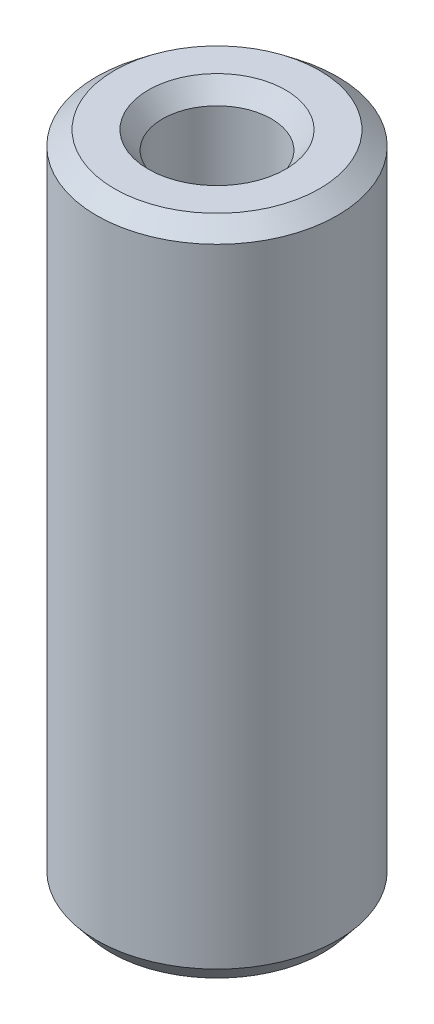
ISO-10303-21;
HEADER;
FILE_DESCRIPTION(('STEP AP214'),'2;1');
FILE_NAME('part.step','',(''),(''),'','','');
FILE_SCHEMA(('AUTOMOTIVE_DESIGN { 1 0 10303 214 1 1 1 1 }'));
ENDSEC;
DATA;
#1=APPLICATION_CONTEXT('core data for automotive mechanical design processes');
#2=APPLICATION_PROTOCOL_DEFINITION('international standard','automotive_design',2000,#1);
#3=PRODUCT_CONTEXT('',#1,'mechanical');
#4=PRODUCT('Part','Part','',(#3));
#5=PRODUCT_RELATED_PRODUCT_CATEGORY('part','',(#4));
#6=PRODUCT_DEFINITION_FORMATION('','',#4);
#7=PRODUCT_DEFINITION_CONTEXT('part definition',#1,'design');
#8=PRODUCT_DEFINITION('design','',#6,#7);
#9=PRODUCT_DEFINITION_SHAPE('','',#8);
#10=(LENGTH_UNIT() NAMED_UNIT(*) SI_UNIT(.MILLI.,.METRE.));
#11=(NAMED_UNIT(*) PLANE_ANGLE_UNIT() SI_UNIT($,.RADIAN.));
#12=(NAMED_UNIT(*) SI_UNIT($,.STERADIAN.) SOLID_ANGLE_UNIT());
#13=UNCERTAINTY_MEASURE_WITH_UNIT(LENGTH_MEASURE(1.E-05),#10,'distance_accuracy_value','');
#14=(GEOMETRIC_REPRESENTATION_CONTEXT(3) GLOBAL_UNCERTAINTY_ASSIGNED_CONTEXT((#13)) GLOBAL_UNIT_ASSIGNED_CONTEXT((#10,
#11,#12)) REPRESENTATION_CONTEXT('',''));
#15=CARTESIAN_POINT('',(0.,0.,0.));
#16=DIRECTION('',(0.,0.,1.));
#17=DIRECTION('',(1.,0.,0.));
#18=AXIS2_PLACEMENT_3D('',#15,#16,#17);
#19=CARTESIAN_POINT('',(0.,95.9355146550826,0.));
#20=DIRECTION('',(0.,-1.,0.));
#21=DIRECTION('',(0.,0.,-1.));
#22=AXIS2_PLACEMENT_3D('',#19,#20,#21);
#23=CYLINDRICAL_SURFACE('',#22,17.5);
#24=CARTESIAN_POINT('',(0.,2.5937585847688,0.));
#25=DIRECTION('',(0.,1.,0.));
#26=DIRECTION('',(0.,0.,1.));
#27=AXIS2_PLACEMENT_3D('',#24,#25,#26);
#28=CIRCLE('',#27,17.5);
#29=CARTESIAN_POINT('',(0.,2.59375858476879,-17.5));
#30=VERTEX_POINT('',#29);
#31=EDGE_CURVE('E10',#30,#30,#28,.T.);
#32=CARTESIAN_POINT('',(0.,93.8617802418051,0.));
#33=DIRECTION('',(0.,1.,0.));
#34=DIRECTION('',(0.,0.,1.));
#35=AXIS2_PLACEMENT_3D('',#32,#33,#34);
#36=CIRCLE('',#35,17.5);
#37=CARTESIAN_POINT('',(0.,93.861780241805,-17.5));
#38=VERTEX_POINT('',#37);
#39=EDGE_CURVE('E50',#38,#38,#36,.F.);
#40=CARTESIAN_POINT('',(0.,2.59375858476879,-17.5));
#41=CARTESIAN_POINT('',(0.,3.54446714369625,-17.5));
#42=CARTESIAN_POINT('',(0.,4.49517570262371,-17.5));
#43=CARTESIAN_POINT('',(0.,6.39659282047863,-17.5));
#44=CARTESIAN_POINT('',(0.,7.34730137940609,-17.5));
#45=CARTESIAN_POINT('',(0.,9.24871849726102,-17.5));
#46=CARTESIAN_POINT('',(0.,10.1994270561885,-17.5));
#47=CARTESIAN_POINT('',(0.,12.1008441740434,-17.5));
#48=CARTESIAN_POINT('',(0.,13.0515527329709,-17.5));
#49=CARTESIAN_POINT('',(0.,14.9529698508258,-17.5));
#50=CARTESIAN_POINT('',(0.,15.9036784097532,-17.5));
#51=CARTESIAN_POINT('',(0.,17.8050955276082,-17.5));
#52=CARTESIAN_POINT('',(0.,18.7558040865356,-17.5));
#53=CARTESIAN_POINT('',(0.,20.6572212043905,-17.5));
#54=CARTESIAN_POINT('',(0.,21.607929763318,-17.5));
#55=CARTESIAN_POINT('',(0.,23.5093468811729,-17.5));
#56=CARTESIAN_POINT('',(0.,24.4600554401004,-17.5));
#57=CARTESIAN_POINT('',(0.,26.3614725579553,-17.5));
#58=CARTESIAN_POINT('',(0.,27.3121811168828,-17.5));
#59=CARTESIAN_POINT('',(0.,29.2135982347377,-17.5));
#60=CARTESIAN_POINT('',(0.,30.1643067936652,-17.5));
#61=CARTESIAN_POINT('',(0.,32.0657239115201,-17.5));
#62=CARTESIAN_POINT('',(0.,33.0164324704475,-17.5));
#63=CARTESIAN_POINT('',(0.,34.9178495883025,-17.5));
#64=CARTESIAN_POINT('',(0.,35.8685581472299,-17.5));
#65=CARTESIAN_POINT('',(0.,37.7699752650848,-17.5));
#66=CARTESIAN_POINT('',(0.,38.7206838240123,-17.5));
#67=CARTESIAN_POINT('',(0.,40.6221009418672,-17.5));
#68=CARTESIAN_POINT('',(0.,41.5728095007947,-17.5));
#69=CARTESIAN_POINT('',(0.,43.4742266186496,-17.5));
#70=CARTESIAN_POINT('',(0.,44.4249351775771,-17.5));
#71=CARTESIAN_POINT('',(0.,46.326352295432,-17.5));
#72=CARTESIAN_POINT('',(0.,47.2770608543595,-17.5));
#73=CARTESIAN_POINT('',(0.,49.1784779722144,-17.5));
#74=CARTESIAN_POINT('',(0.,50.1291865311418,-17.5));
#75=CARTESIAN_POINT('',(0.,52.0306036489968,-17.5));
#76=CARTESIAN_POINT('',(0.,52.9813122079242,-17.5));
#77=CARTESIAN_POINT('',(0.,54.8827293257791,-17.5));
#78=CARTESIAN_POINT('',(0.,55.8334378847066,-17.5));
#79=CARTESIAN_POINT('',(0.,57.7348550025615,-17.5));
#80=CARTESIAN_POINT('',(0.,58.685563561489,-17.5));
#81=CARTESIAN_POINT('',(0.,60.5869806793439,-17.5));
#82=CARTESIAN_POINT('',(0.,61.5376892382714,-17.5));
#83=CARTESIAN_POINT('',(0.,63.4391063561263,-17.5));
#84=CARTESIAN_POINT('',(0.,64.3898149150537,-17.5));
#85=CARTESIAN_POINT('',(0.,66.2912320329087,-17.5));
#86=CARTESIAN_POINT('',(0.,67.2419405918361,-17.5));
#87=CARTESIAN_POINT('',(0.,69.143357709691,-17.5));
#88=CARTESIAN_POINT('',(0.,70.0940662686185,-17.5));
#89=CARTESIAN_POINT('',(0.,71.9954833864734,-17.5));
#90=CARTESIAN_POINT('',(0.,72.9461919454009,-17.5));
#91=CARTESIAN_POINT('',(0.,74.8476090632558,-17.5));
#92=CARTESIAN_POINT('',(0.,75.7983176221833,-17.5));
#93=CARTESIAN_POINT('',(0.,77.6997347400382,-17.5));
#94=CARTESIAN_POINT('',(0.,78.6504432989657,-17.5));
#95=CARTESIAN_POINT('',(0.,80.5518604168206,-17.5));
#96=CARTESIAN_POINT('',(0.,81.502568975748,-17.5));
#97=CARTESIAN_POINT('',(0.,83.403986093603,-17.5));
#98=CARTESIAN_POINT('',(0.,84.3546946525304,-17.5));
#99=CARTESIAN_POINT('',(0.,86.2561117703853,-17.5));
#100=CARTESIAN_POINT('',(0.,87.2068203293128,-17.5));
#101=CARTESIAN_POINT('',(0.,89.1082374471677,-17.5));
#102=CARTESIAN_POINT('',(0.,90.0589460060952,-17.5));
#103=CARTESIAN_POINT('',(0.,91.9603631239501,-17.5));
#104=CARTESIAN_POINT('',(0.,92.9110716828776,-17.5));
#105=CARTESIAN_POINT('',(0.,93.861780241805,-17.5));
#106=B_SPLINE_CURVE_WITH_KNOTS('',3,(#40,#41,#42,#43,#44,#45,#46,#47,#48,#49,#50,#51,#52,#53,
#54,#55,#56,#57,#58,#59,#60,#61,#62,#63,#64,#65,#66,#67,#68,#69,#70,#71,#72,#73,#74,#75,#76,#77,
#78,#79,#80,#81,#82,#83,#84,#85,#86,#87,#88,#89,#90,#91,#92,#93,#94,#95,#96,#97,#98,#99,#100,
#101,#102,#103,#104,#105),.UNSPECIFIED.,.F.,.F.,(4,2,2,2,2,2,2,2,2,2,2,2,2,2,2,2,2,2,2,2,2,2,2,
2,2,2,2,2,2,2,2,2,4),(0.,2.85212567678238,5.70425135356477,8.55637703034714,11.4085027071295,
14.2606283839119,17.1127540606943,19.9648797374767,22.8170054142591,25.6691310910415,
28.5212567678238,31.3733824446062,34.2255081213886,37.077633798171,39.9297594749534,
42.7818851517357,45.6340108285181,48.4861365053005,51.3382621820829,54.1903878588653,
57.0425135356477,59.89463921243,62.7467648892124,65.5988905659948,68.4510162427772,
71.3031419195596,74.1552675963419,77.0073932731243,79.8595189499067,82.7116446266891,
85.5637703034715,88.4158959802539,91.2680216570362),.UNSPECIFIED.);
#107=EDGE_CURVE('BSEAM39',#30,#38,#106,.T.);
#108=ORIENTED_EDGE('',*,*,#31,.T.);
#109=ORIENTED_EDGE('',*,*,#39,.T.);
#110=ORIENTED_EDGE('',*,*,#107,.T.);
#111=ORIENTED_EDGE('',*,*,#107,.F.);
#112=EDGE_LOOP('',(#108,#110,#109,#111));
#113=FACE_BOUND('',#112,.T.);
#114=ADVANCED_FACE('F39',(#113),#23,.T.);
#115=CARTESIAN_POINT('',(0.,95.9355146550826,0.));
#116=DIRECTION('',(0.,1.,0.));
#117=DIRECTION('',(0.,0.,1.));
#118=AXIS2_PLACEMENT_3D('',#115,#116,#117);
#119=PLANE('',#118);
#120=CARTESIAN_POINT('',(0.,95.9355146550826,0.));
#121=DIRECTION('',(0.,1.,0.));
#122=DIRECTION('',(0.,0.,1.));
#123=AXIS2_PLACEMENT_3D('',#120,#121,#122);
#124=CIRCLE('',#123,9.98302959360785);
#125=CARTESIAN_POINT('',(0.,95.9355146550826,9.98302959360785));
#126=VERTEX_POINT('',#125);
#127=EDGE_CURVE('E58',#126,#126,#124,.F.);
#128=ORIENTED_EDGE('',*,*,#127,.T.);
#129=EDGE_LOOP('',(#128));
#130=FACE_BOUND('',#129,.T.);
#131=CARTESIAN_POINT('',(0.,95.9355146550826,0.));
#132=DIRECTION('',(0.,1.,0.));
#133=DIRECTION('',(0.,0.,1.));
#134=AXIS2_PLACEMENT_3D('',#131,#132,#133);
#135=CIRCLE('',#134,14.9062414152314);
#136=CARTESIAN_POINT('',(0.,95.9355146550826,14.9062414152314));
#137=VERTEX_POINT('',#136);
#138=EDGE_CURVE('E61',#137,#137,#135,.T.);
#139=ORIENTED_EDGE('',*,*,#138,.T.);
#140=EDGE_LOOP('',(#139));
#141=FACE_BOUND('',#140,.T.);
#142=ADVANCED_FACE('F88',(#130,#141),#119,.T.);
#143=CARTESIAN_POINT('',(0.,0.,0.));
#144=DIRECTION('',(0.,1.,0.));
#145=DIRECTION('',(0.,0.,1.));
#146=AXIS2_PLACEMENT_3D('',#143,#144,#145);
#147=PLANE('',#146);
#148=CARTESIAN_POINT('',(0.,0.,0.));
#149=DIRECTION('',(0.,1.,0.));
#150=DIRECTION('',(0.,0.,1.));
#151=AXIS2_PLACEMENT_3D('',#148,#149,#150);
#152=CIRCLE('',#151,10.5030537650989);
#153=CARTESIAN_POINT('',(0.,0.,10.5030537650989));
#154=VERTEX_POINT('',#153);
#155=EDGE_CURVE('E51',#154,#154,#152,.T.);
#156=ORIENTED_EDGE('',*,*,#155,.T.);
#157=EDGE_LOOP('',(#156));
#158=FACE_BOUND('',#157,.T.);
#159=CARTESIAN_POINT('',(0.,0.,0.));
#160=DIRECTION('',(0.,1.,0.));
#161=DIRECTION('',(0.,0.,1.));
#162=AXIS2_PLACEMENT_3D('',#159,#160,#161);
#163=CIRCLE('',#162,15.4262655867223);
#164=CARTESIAN_POINT('',(0.,0.,15.4262655867223));
#165=VERTEX_POINT('',#164);
#166=EDGE_CURVE('E54',#165,#165,#163,.F.);
#167=ORIENTED_EDGE('',*,*,#166,.T.);
#168=EDGE_LOOP('',(#167));
#169=FACE_BOUND('',#168,.T.);
#170=ADVANCED_FACE('F83',(#158,#169),#147,.F.);
#171=CARTESIAN_POINT('',(0.,95.9355146550826,0.));
#172=DIRECTION('',(0.,-1.,0.));
#173=DIRECTION('',(0.,0.,-1.));
#174=AXIS2_PLACEMENT_3D('',#171,#172,#173);
#175=CYLINDRICAL_SURFACE('',#174,7.90929518033019);
#176=CARTESIAN_POINT('',(0.,93.3417560703138,0.));
#177=DIRECTION('',(0.,1.,0.));
#178=DIRECTION('',(0.,0.,1.));
#179=AXIS2_PLACEMENT_3D('',#176,#177,#178);
#180=CIRCLE('',#179,7.90929518033019);
#181=CARTESIAN_POINT('',(0.,93.3417560703138,-7.90929518033019));
#182=VERTEX_POINT('',#181);
#183=EDGE_CURVE('E67',#182,#182,#180,.T.);
#184=CARTESIAN_POINT('',(0.,2.07373441327757,0.));
#185=DIRECTION('',(0.,1.,0.));
#186=DIRECTION('',(0.,0.,1.));
#187=AXIS2_PLACEMENT_3D('',#184,#185,#186);
#188=CIRCLE('',#187,7.90929518033019);
#189=CARTESIAN_POINT('',(0.,2.07373441327757,-7.90929518033019));
#190=VERTEX_POINT('',#189);
#191=EDGE_CURVE('E69',#190,#190,#188,.F.);
#192=CARTESIAN_POINT('',(0.,93.3417560703138,-7.90929518033019));
#193=CARTESIAN_POINT('',(0.,92.3910475113863,-7.90929518033019));
#194=CARTESIAN_POINT('',(0.,91.4403389524588,-7.90929518033019));
#195=CARTESIAN_POINT('',(0.,89.5389218346039,-7.90929518033019));
#196=CARTESIAN_POINT('',(0.,88.5882132756765,-7.90929518033019));
#197=CARTESIAN_POINT('',(0.,86.6867961578216,-7.90929518033019));
#198=CARTESIAN_POINT('',(0.,85.7360875988941,-7.90929518033019));
#199=CARTESIAN_POINT('',(0.,83.8346704810392,-7.90929518033019));
#200=CARTESIAN_POINT('',(0.,82.8839619221117,-7.90929518033019));
#201=CARTESIAN_POINT('',(0.,80.9825448042568,-7.90929518033019));
#202=CARTESIAN_POINT('',(0.,80.0318362453293,-7.90929518033019));
#203=CARTESIAN_POINT('',(0.,78.1304191274744,-7.90929518033019));
#204=CARTESIAN_POINT('',(0.,77.1797105685469,-7.90929518033019));
#205=CARTESIAN_POINT('',(0.,75.278293450692,-7.90929518033019));
#206=CARTESIAN_POINT('',(0.,74.3275848917646,-7.90929518033019));
#207=CARTESIAN_POINT('',(0.,72.4261677739096,-7.90929518033019));
#208=CARTESIAN_POINT('',(0.,71.4754592149822,-7.90929518033019));
#209=CARTESIAN_POINT('',(0.,69.5740420971273,-7.90929518033019));
#210=CARTESIAN_POINT('',(0.,68.6233335381998,-7.90929518033019));
#211=CARTESIAN_POINT('',(0.,66.7219164203449,-7.90929518033019));
#212=CARTESIAN_POINT('',(0.,65.7712078614174,-7.90929518033019));
#213=CARTESIAN_POINT('',(0.,63.8697907435625,-7.90929518033019));
#214=CARTESIAN_POINT('',(0.,62.919082184635,-7.90929518033019));
#215=CARTESIAN_POINT('',(0.,61.0176650667801,-7.90929518033019));
#216=CARTESIAN_POINT('',(0.,60.0669565078527,-7.90929518033019));
#217=CARTESIAN_POINT('',(0.,58.1655393899977,-7.90929518033019));
#218=CARTESIAN_POINT('',(0.,57.2148308310703,-7.90929518033019));
#219=CARTESIAN_POINT('',(0.,55.3134137132154,-7.90929518033019));
#220=CARTESIAN_POINT('',(0.,54.3627051542879,-7.90929518033019));
#221=CARTESIAN_POINT('',(0.,52.461288036433,-7.90929518033019));
#222=CARTESIAN_POINT('',(0.,51.5105794775055,-7.90929518033019));
#223=CARTESIAN_POINT('',(0.,49.6091623596506,-7.90929518033019));
#224=CARTESIAN_POINT('',(0.,48.6584538007231,-7.90929518033019));
#225=CARTESIAN_POINT('',(0.,46.7570366828682,-7.90929518033019));
#226=CARTESIAN_POINT('',(0.,45.8063281239408,-7.90929518033019));
#227=CARTESIAN_POINT('',(0.,43.9049110060858,-7.90929518033019));
#228=CARTESIAN_POINT('',(0.,42.9542024471584,-7.90929518033019));
#229=CARTESIAN_POINT('',(0.,41.0527853293035,-7.90929518033019));
#230=CARTESIAN_POINT('',(0.,40.102076770376,-7.90929518033019));
#231=CARTESIAN_POINT('',(0.,38.2006596525211,-7.90929518033019));
#232=CARTESIAN_POINT('',(0.,37.2499510935936,-7.90929518033019));
#233=CARTESIAN_POINT('',(0.,35.3485339757387,-7.90929518033019));
#234=CARTESIAN_POINT('',(0.,34.3978254168112,-7.90929518033019));
#235=CARTESIAN_POINT('',(0.,32.4964082989563,-7.90929518033019));
#236=CARTESIAN_POINT('',(0.,31.5456997400288,-7.90929518033019));
#237=CARTESIAN_POINT('',(0.,29.6442826221739,-7.90929518033019));
#238=CARTESIAN_POINT('',(0.,28.6935740632465,-7.90929518033019));
#239=CARTESIAN_POINT('',(0.,26.7921569453915,-7.90929518033019));
#240=CARTESIAN_POINT('',(0.,25.8414483864641,-7.90929518033019));
#241=CARTESIAN_POINT('',(0.,23.9400312686092,-7.90929518033019));
#242=CARTESIAN_POINT('',(0.,22.9893227096817,-7.90929518033019));
#243=CARTESIAN_POINT('',(0.,21.0879055918268,-7.90929518033019));
#244=CARTESIAN_POINT('',(0.,20.1371970328993,-7.90929518033019));
#245=CARTESIAN_POINT('',(0.,18.2357799150444,-7.90929518033019));
#246=CARTESIAN_POINT('',(0.,17.2850713561169,-7.90929518033019));
#247=CARTESIAN_POINT('',(0.,15.383654238262,-7.90929518033019));
#248=CARTESIAN_POINT('',(0.,14.4329456793346,-7.90929518033019));
#249=CARTESIAN_POINT('',(0.,12.5315285614796,-7.90929518033019));
#250=CARTESIAN_POINT('',(0.,11.5808200025522,-7.90929518033019));
#251=CARTESIAN_POINT('',(0.,9.67940288469726,-7.90929518033019));
#252=CARTESIAN_POINT('',(0.,8.7286943257698,-7.90929518033019));
#253=CARTESIAN_POINT('',(0.,6.82727720791488,-7.90929518033019));
#254=CARTESIAN_POINT('',(0.,5.87656864898741,-7.90929518033019));
#255=CARTESIAN_POINT('',(0.,3.97515153113249,-7.90929518033019));
#256=CARTESIAN_POINT('',(0.,3.02444297220503,-7.90929518033019));
#257=CARTESIAN_POINT('',(0.,2.07373441327757,-7.90929518033019));
#258=B_SPLINE_CURVE_WITH_KNOTS('',3,(#192,#193,#194,#195,#196,#197,#198,#199,#200,#201,#202,
#203,#204,#205,#206,#207,#208,#209,#210,#211,#212,#213,#214,#215,#216,#217,#218,#219,#220,#221,
#222,#223,#224,#225,#226,#227,#228,#229,#230,#231,#232,#233,#234,#235,#236,#237,#238,#239,#240,
#241,#242,#243,#244,#245,#246,#247,#248,#249,#250,#251,#252,#253,#254,#255,#256,#257),
.UNSPECIFIED.,.F.,.F.,(4,2,2,2,2,2,2,2,2,2,2,2,2,2,2,2,2,2,2,2,2,2,2,2,2,2,2,2,2,2,2,2,4),(0.,
2.85212567678238,5.70425135356475,8.55637703034713,11.4085027071295,14.2606283839119,
17.1127540606943,19.9648797374767,22.817005414259,25.6691310910414,28.5212567678238,
31.3733824446062,34.2255081213886,37.0776337981709,39.9297594749533,42.7818851517357,
45.6340108285181,48.4861365053005,51.3382621820829,54.1903878588652,57.0425135356476,
59.89463921243,62.7467648892124,65.5988905659948,68.4510162427771,71.3031419195595,
74.1552675963419,77.0073932731243,79.8595189499067,82.7116446266891,85.5637703034714,
88.4158959802538,91.2680216570362),.UNSPECIFIED.);
#259=EDGE_CURVE('BSEAM71',#182,#190,#258,.T.);
#260=ORIENTED_EDGE('',*,*,#183,.T.);
#261=ORIENTED_EDGE('',*,*,#191,.T.);
#262=ORIENTED_EDGE('',*,*,#259,.T.);
#263=ORIENTED_EDGE('',*,*,#259,.F.);
#264=EDGE_LOOP('',(#260,#262,#261,#263));
#265=FACE_BOUND('',#264,.T.);
#266=ADVANCED_FACE('F71',(#265),#175,.F.);
#267=CARTESIAN_POINT('',(0.,93.3417560703138,0.));
#268=DIRECTION('',(0.,1.,0.));
#269=DIRECTION('',(0.,0.,1.));
#270=AXIS2_PLACEMENT_3D('',#267,#268,#269);
#271=CONICAL_SURFACE('',#270,7.90929518033019,0.674441734496383);
#272=ORIENTED_EDGE('',*,*,#127,.F.);
#273=EDGE_LOOP('',(#272));
#274=FACE_BOUND('',#273,.T.);
#275=ORIENTED_EDGE('',*,*,#183,.F.);
#276=EDGE_LOOP('',(#275));
#277=FACE_BOUND('',#276,.T.);
#278=ADVANCED_FACE('F77',(#274,#277),#271,.F.);
#279=CARTESIAN_POINT('',(0.,0.,0.));
#280=DIRECTION('',(0.,-1.,0.));
#281=DIRECTION('',(0.,0.,-1.));
#282=AXIS2_PLACEMENT_3D('',#279,#280,#281);
#283=CONICAL_SURFACE('',#282,10.5030537650989,0.89635459229851);
#284=ORIENTED_EDGE('',*,*,#191,.F.);
#285=EDGE_LOOP('',(#284));
#286=FACE_BOUND('',#285,.T.);
#287=ORIENTED_EDGE('',*,*,#155,.F.);
#288=EDGE_LOOP('',(#287));
#289=FACE_BOUND('',#288,.T.);
#290=ADVANCED_FACE('F73',(#286,#289),#283,.F.);
#291=CARTESIAN_POINT('',(0.,2.5937585847688,0.));
#292=DIRECTION('',(0.,1.,0.));
#293=DIRECTION('',(0.,0.,1.));
#294=AXIS2_PLACEMENT_3D('',#291,#292,#293);
#295=CONICAL_SURFACE('',#294,17.5,0.674441734496383);
#296=ORIENTED_EDGE('',*,*,#166,.F.);
#297=EDGE_LOOP('',(#296));
#298=FACE_BOUND('',#297,.T.);
#299=ORIENTED_EDGE('',*,*,#31,.F.);
#300=EDGE_LOOP('',(#299));
#301=FACE_BOUND('',#300,.T.);
#302=ADVANCED_FACE('F76',(#298,#301),#295,.T.);
#303=CARTESIAN_POINT('',(0.,95.9355146550826,0.));
#304=DIRECTION('',(0.,-1.,0.));
#305=DIRECTION('',(0.,0.,-1.));
#306=AXIS2_PLACEMENT_3D('',#303,#304,#305);
#307=CONICAL_SURFACE('',#306,14.9062414152314,0.896354592298513);
#308=ORIENTED_EDGE('',*,*,#39,.F.);
#309=EDGE_LOOP('',(#308));
#310=FACE_BOUND('',#309,.T.);
#311=ORIENTED_EDGE('',*,*,#138,.F.);
#312=EDGE_LOOP('',(#311));
#313=FACE_BOUND('',#312,.T.);
#314=ADVANCED_FACE('F45',(#310,#313),#307,.T.);
#315=CLOSED_SHELL('',(#114,#142,#170,#266,#278,#290,#302,#314));
#316=MANIFOLD_SOLID_BREP('B2',#315);
#317=ADVANCED_BREP_SHAPE_REPRESENTATION('',(#18,#316),#14);
#318=SHAPE_DEFINITION_REPRESENTATION(#9,#317);
ENDSEC;
END-ISO-10303-21;
